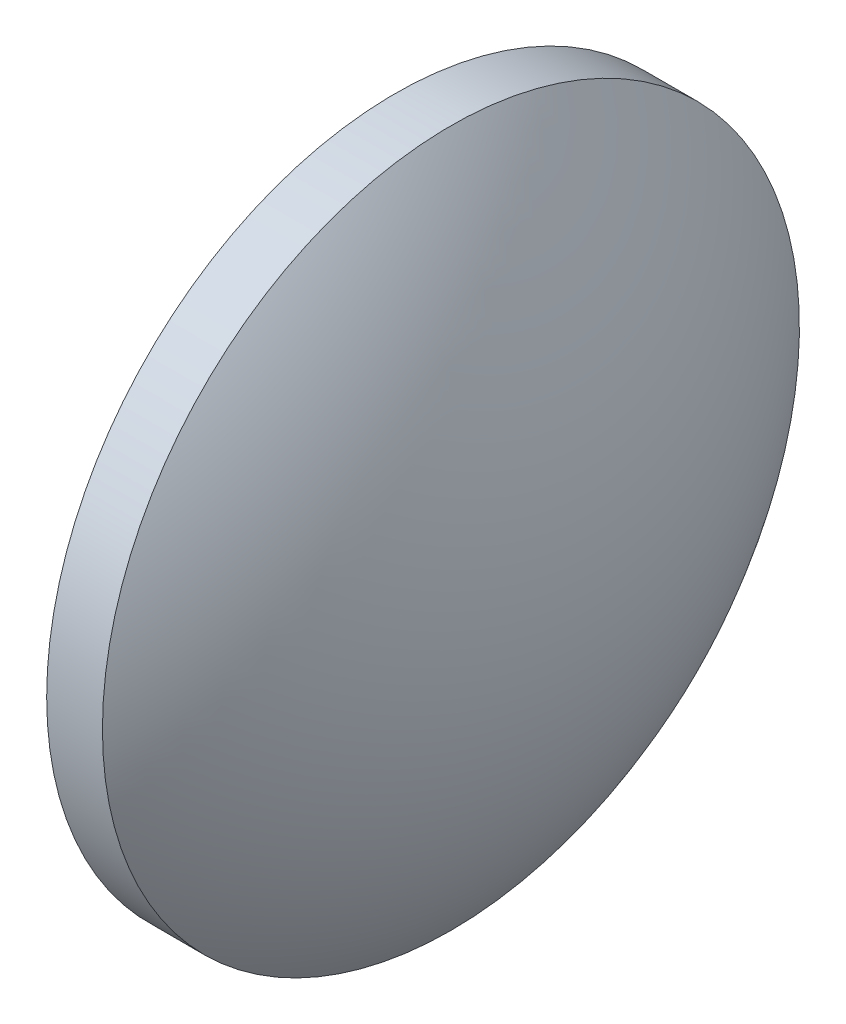
ISO-10303-21;
HEADER;
FILE_DESCRIPTION(('STEP AP214'),'2;1');
FILE_NAME('part.step','',(''),(''),'','','');
FILE_SCHEMA(('AUTOMOTIVE_DESIGN { 1 0 10303 214 1 1 1 1 }'));
ENDSEC;
DATA;
#1=APPLICATION_CONTEXT('core data for automotive mechanical design processes');
#2=APPLICATION_PROTOCOL_DEFINITION('international standard','automotive_design',2000,#1);
#3=PRODUCT_CONTEXT('',#1,'mechanical');
#4=PRODUCT('Part','Part','',(#3));
#5=PRODUCT_RELATED_PRODUCT_CATEGORY('part','',(#4));
#6=PRODUCT_DEFINITION_FORMATION('','',#4);
#7=PRODUCT_DEFINITION_CONTEXT('part definition',#1,'design');
#8=PRODUCT_DEFINITION('design','',#6,#7);
#9=PRODUCT_DEFINITION_SHAPE('','',#8);
#10=(LENGTH_UNIT() NAMED_UNIT(*) SI_UNIT(.MILLI.,.METRE.));
#11=(NAMED_UNIT(*) PLANE_ANGLE_UNIT() SI_UNIT($,.RADIAN.));
#12=(NAMED_UNIT(*) SI_UNIT($,.STERADIAN.) SOLID_ANGLE_UNIT());
#13=UNCERTAINTY_MEASURE_WITH_UNIT(LENGTH_MEASURE(1.E-05),#10,'distance_accuracy_value','');
#14=(GEOMETRIC_REPRESENTATION_CONTEXT(3) GLOBAL_UNCERTAINTY_ASSIGNED_CONTEXT((#13)) GLOBAL_UNIT_ASSIGNED_CONTEXT((#10,
#11,#12)) REPRESENTATION_CONTEXT('',''));
#15=CARTESIAN_POINT('',(0.,0.,0.));
#16=DIRECTION('',(0.,0.,1.));
#17=DIRECTION('',(1.,0.,0.));
#18=AXIS2_PLACEMENT_3D('',#15,#16,#17);
#19=CARTESIAN_POINT('',(620.234578799571,47.9465531255733,0.));
#20=DIRECTION('',(-1.,0.,0.));
#21=DIRECTION('',(0.,-1.,0.));
#22=AXIS2_PLACEMENT_3D('',#19,#20,#21);
#23=SPHERICAL_SURFACE('',#22,20.6620071258907);
#24=CARTESIAN_POINT('',(636.686585925461,47.9465531255732,0.));
#25=DIRECTION('',(-1.,0.,0.));
#26=DIRECTION('',(0.,0.,1.));
#27=AXIS2_PLACEMENT_3D('',#24,#25,#26);
#28=CIRCLE('',#27,12.5);
#29=CARTESIAN_POINT('',(636.686585925461,47.9465531255732,12.5));
#30=VERTEX_POINT('',#29);
#31=EDGE_CURVE('E10',#30,#30,#28,.T.);
#32=ORIENTED_EDGE('',*,*,#31,.F.);
#33=EDGE_LOOP('',(#32));
#34=FACE_BOUND('',#33,.T.);
#35=ADVANCED_FACE('F35',(#34),#23,.T.);
#36=CARTESIAN_POINT('',(632.657478347024,47.9465531255732,0.));
#37=DIRECTION('',(-1.,0.,0.));
#38=DIRECTION('',(0.,0.,1.));
#39=AXIS2_PLACEMENT_3D('',#36,#37,#38);
#40=CYLINDRICAL_SURFACE('',#39,12.5);
#41=CARTESIAN_POINT('',(634.686585925461,47.9465531255732,0.));
#42=DIRECTION('',(-1.,0.,0.));
#43=DIRECTION('',(0.,0.,1.));
#44=AXIS2_PLACEMENT_3D('',#41,#42,#43);
#45=CIRCLE('',#44,12.5);
#46=CARTESIAN_POINT('',(634.686585925461,47.9465531255732,12.5));
#47=VERTEX_POINT('',#46);
#48=EDGE_CURVE('E41',#47,#47,#45,.T.);
#49=ORIENTED_EDGE('',*,*,#48,.F.);
#50=EDGE_LOOP('',(#49));
#51=FACE_BOUND('',#50,.T.);
#52=ORIENTED_EDGE('',*,*,#31,.T.);
#53=EDGE_LOOP('',(#52));
#54=FACE_BOUND('',#53,.T.);
#55=ADVANCED_FACE('F49',(#51,#54),#40,.T.);
#56=CARTESIAN_POINT('',(634.686585925461,47.9465531255732,0.));
#57=DIRECTION('',(1.,0.,0.));
#58=DIRECTION('',(0.,0.,-1.));
#59=AXIS2_PLACEMENT_3D('',#56,#57,#58);
#60=PLANE('',#59);
#61=ORIENTED_EDGE('',*,*,#48,.T.);
#62=EDGE_LOOP('',(#61));
#63=FACE_BOUND('',#62,.T.);
#64=ADVANCED_FACE('F47',(#63),#60,.F.);
#65=CLOSED_SHELL('',(#35,#55,#64));
#66=MANIFOLD_SOLID_BREP('B2',#65);
#67=ADVANCED_BREP_SHAPE_REPRESENTATION('',(#18,#66),#14);
#68=SHAPE_DEFINITION_REPRESENTATION(#9,#67);
ENDSEC;
END-ISO-10303-21;
